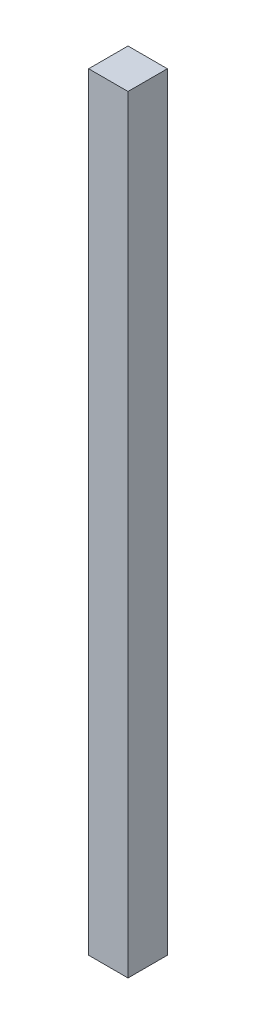
ISO-10303-21;
HEADER;
FILE_DESCRIPTION(('STEP AP214'),'2;1');
FILE_NAME('part.step','',(''),(''),'','','');
FILE_SCHEMA(('AUTOMOTIVE_DESIGN { 1 0 10303 214 1 1 1 1 }'));
ENDSEC;
DATA;
#1=APPLICATION_CONTEXT('core data for automotive mechanical design processes');
#2=APPLICATION_PROTOCOL_DEFINITION('international standard','automotive_design',2000,#1);
#3=PRODUCT_CONTEXT('',#1,'mechanical');
#4=PRODUCT('Part','Part','',(#3));
#5=PRODUCT_RELATED_PRODUCT_CATEGORY('part','',(#4));
#6=PRODUCT_DEFINITION_FORMATION('','',#4);
#7=PRODUCT_DEFINITION_CONTEXT('part definition',#1,'design');
#8=PRODUCT_DEFINITION('design','',#6,#7);
#9=PRODUCT_DEFINITION_SHAPE('','',#8);
#10=(LENGTH_UNIT() NAMED_UNIT(*) SI_UNIT(.MILLI.,.METRE.));
#11=(NAMED_UNIT(*) PLANE_ANGLE_UNIT() SI_UNIT($,.RADIAN.));
#12=(NAMED_UNIT(*) SI_UNIT($,.STERADIAN.) SOLID_ANGLE_UNIT());
#13=UNCERTAINTY_MEASURE_WITH_UNIT(LENGTH_MEASURE(1.E-05),#10,'distance_accuracy_value','');
#14=(GEOMETRIC_REPRESENTATION_CONTEXT(3) GLOBAL_UNCERTAINTY_ASSIGNED_CONTEXT((#13)) GLOBAL_UNIT_ASSIGNED_CONTEXT((#10,
#11,#12)) REPRESENTATION_CONTEXT('',''));
#15=CARTESIAN_POINT('',(0.,0.,0.));
#16=DIRECTION('',(0.,0.,1.));
#17=DIRECTION('',(1.,0.,0.));
#18=AXIS2_PLACEMENT_3D('',#15,#16,#17);
#19=CARTESIAN_POINT('',(1.5875,-30.96006,3.175));
#20=DIRECTION('',(-1.,0.,0.));
#21=DIRECTION('',(0.,0.,1.));
#22=AXIS2_PLACEMENT_3D('',#19,#20,#21);
#23=PLANE('',#22);
#24=DIRECTION('',(0.,1.,0.));
#25=VECTOR('',#24,1.);
#26=CARTESIAN_POINT('',(1.5875,-30.96006,0.));
#27=LINE('',#26,#25);
#28=CARTESIAN_POINT('',(1.5875,-30.96006,0.));
#29=VERTEX_POINT('',#28);
#30=CARTESIAN_POINT('',(1.5875,30.96006,0.));
#31=VERTEX_POINT('',#30);
#32=EDGE_CURVE('E112',#29,#31,#27,.T.);
#33=ORIENTED_EDGE('',*,*,#32,.T.);
#34=DIRECTION('',(0.,0.,-1.));
#35=VECTOR('',#34,1.);
#36=CARTESIAN_POINT('',(1.5875,30.96006,3.175));
#37=LINE('',#36,#35);
#38=CARTESIAN_POINT('',(1.5875,30.96006,3.175));
#39=VERTEX_POINT('',#38);
#40=EDGE_CURVE('E11',#39,#31,#37,.T.);
#41=ORIENTED_EDGE('',*,*,#40,.F.);
#42=DIRECTION('',(0.,1.,0.));
#43=VECTOR('',#42,1.);
#44=CARTESIAN_POINT('',(1.5875,-30.96006,3.175));
#45=LINE('',#44,#43);
#46=CARTESIAN_POINT('',(1.5875,-30.96006,3.175));
#47=VERTEX_POINT('',#46);
#48=EDGE_CURVE('E96',#47,#39,#45,.T.);
#49=ORIENTED_EDGE('',*,*,#48,.F.);
#50=DIRECTION('',(0.,0.,-1.));
#51=VECTOR('',#50,1.);
#52=CARTESIAN_POINT('',(1.5875,-30.96006,3.175));
#53=LINE('',#52,#51);
#54=EDGE_CURVE('E108',#47,#29,#53,.T.);
#55=ORIENTED_EDGE('',*,*,#54,.T.);
#56=EDGE_LOOP('',(#33,#41,#49,#55));
#57=FACE_BOUND('',#56,.T.);
#58=ADVANCED_FACE('F44',(#57),#23,.F.);
#59=CARTESIAN_POINT('',(-1.5875,30.96006,3.175));
#60=DIRECTION('',(0.,-1.,0.));
#61=DIRECTION('',(0.,0.,-1.));
#62=AXIS2_PLACEMENT_3D('',#59,#60,#61);
#63=PLANE('',#62);
#64=DIRECTION('',(-1.,0.,0.));
#65=VECTOR('',#64,1.);
#66=CARTESIAN_POINT('',(-1.5875,30.96006,0.));
#67=LINE('',#66,#65);
#68=CARTESIAN_POINT('',(-1.5875,30.96006,0.));
#69=VERTEX_POINT('',#68);
#70=EDGE_CURVE('E101',#31,#69,#67,.T.);
#71=ORIENTED_EDGE('',*,*,#70,.T.);
#72=DIRECTION('',(0.,0.,-1.));
#73=VECTOR('',#72,1.);
#74=CARTESIAN_POINT('',(-1.5875,30.96006,3.175));
#75=LINE('',#74,#73);
#76=CARTESIAN_POINT('',(-1.5875,30.96006,3.175));
#77=VERTEX_POINT('',#76);
#78=EDGE_CURVE('E53',#77,#69,#75,.T.);
#79=ORIENTED_EDGE('',*,*,#78,.F.);
#80=DIRECTION('',(-1.,0.,0.));
#81=VECTOR('',#80,1.);
#82=CARTESIAN_POINT('',(-1.5875,30.96006,3.175));
#83=LINE('',#82,#81);
#84=EDGE_CURVE('E91',#39,#77,#83,.T.);
#85=ORIENTED_EDGE('',*,*,#84,.F.);
#86=ORIENTED_EDGE('',*,*,#40,.T.);
#87=EDGE_LOOP('',(#71,#79,#85,#86));
#88=FACE_BOUND('',#87,.T.);
#89=ADVANCED_FACE('F100',(#88),#63,.F.);
#90=CARTESIAN_POINT('',(-1.5875,-30.96006,3.175));
#91=DIRECTION('',(1.,0.,0.));
#92=DIRECTION('',(0.,0.,-1.));
#93=AXIS2_PLACEMENT_3D('',#90,#91,#92);
#94=PLANE('',#93);
#95=DIRECTION('',(0.,-1.,0.));
#96=VECTOR('',#95,1.);
#97=CARTESIAN_POINT('',(-1.5875,-30.96006,0.));
#98=LINE('',#97,#96);
#99=CARTESIAN_POINT('',(-1.5875,-30.96006,0.));
#100=VERTEX_POINT('',#99);
#101=EDGE_CURVE('E78',#69,#100,#98,.T.);
#102=ORIENTED_EDGE('',*,*,#101,.T.);
#103=DIRECTION('',(0.,0.,-1.));
#104=VECTOR('',#103,1.);
#105=CARTESIAN_POINT('',(-1.5875,-30.96006,3.175));
#106=LINE('',#105,#104);
#107=CARTESIAN_POINT('',(-1.5875,-30.96006,3.175));
#108=VERTEX_POINT('',#107);
#109=EDGE_CURVE('E103',#108,#100,#106,.T.);
#110=ORIENTED_EDGE('',*,*,#109,.F.);
#111=DIRECTION('',(0.,-1.,0.));
#112=VECTOR('',#111,1.);
#113=CARTESIAN_POINT('',(-1.5875,-30.96006,3.175));
#114=LINE('',#113,#112);
#115=EDGE_CURVE('E94',#77,#108,#114,.T.);
#116=ORIENTED_EDGE('',*,*,#115,.F.);
#117=ORIENTED_EDGE('',*,*,#78,.T.);
#118=EDGE_LOOP('',(#102,#110,#116,#117));
#119=FACE_BOUND('',#118,.T.);
#120=ADVANCED_FACE('F104',(#119),#94,.F.);
#121=CARTESIAN_POINT('',(-1.5875,-30.96006,3.175));
#122=DIRECTION('',(0.,1.,0.));
#123=DIRECTION('',(0.,0.,1.));
#124=AXIS2_PLACEMENT_3D('',#121,#122,#123);
#125=PLANE('',#124);
#126=DIRECTION('',(1.,0.,0.));
#127=VECTOR('',#126,1.);
#128=CARTESIAN_POINT('',(-1.5875,-30.96006,0.));
#129=LINE('',#128,#127);
#130=EDGE_CURVE('E84',#100,#29,#129,.T.);
#131=ORIENTED_EDGE('',*,*,#130,.T.);
#132=ORIENTED_EDGE('',*,*,#54,.F.);
#133=DIRECTION('',(1.,0.,0.));
#134=VECTOR('',#133,1.);
#135=CARTESIAN_POINT('',(-1.5875,-30.96006,3.175));
#136=LINE('',#135,#134);
#137=EDGE_CURVE('E61',#108,#47,#136,.T.);
#138=ORIENTED_EDGE('',*,*,#137,.F.);
#139=ORIENTED_EDGE('',*,*,#109,.T.);
#140=EDGE_LOOP('',(#131,#132,#138,#139));
#141=FACE_BOUND('',#140,.T.);
#142=ADVANCED_FACE('F125',(#141),#125,.F.);
#143=CARTESIAN_POINT('',(0.,0.,3.175));
#144=DIRECTION('',(0.,0.,-1.));
#145=DIRECTION('',(-1.,0.,0.));
#146=AXIS2_PLACEMENT_3D('',#143,#144,#145);
#147=PLANE('',#146);
#148=ORIENTED_EDGE('',*,*,#48,.T.);
#149=ORIENTED_EDGE('',*,*,#84,.T.);
#150=ORIENTED_EDGE('',*,*,#115,.T.);
#151=ORIENTED_EDGE('',*,*,#137,.T.);
#152=EDGE_LOOP('',(#148,#149,#150,#151));
#153=FACE_BOUND('',#152,.T.);
#154=ADVANCED_FACE('F92',(#153),#147,.F.);
#155=CARTESIAN_POINT('',(0.,0.,0.));
#156=DIRECTION('',(0.,0.,-1.));
#157=DIRECTION('',(-1.,0.,0.));
#158=AXIS2_PLACEMENT_3D('',#155,#156,#157);
#159=PLANE('',#158);
#160=ORIENTED_EDGE('',*,*,#32,.F.);
#161=ORIENTED_EDGE('',*,*,#130,.F.);
#162=ORIENTED_EDGE('',*,*,#101,.F.);
#163=ORIENTED_EDGE('',*,*,#70,.F.);
#164=EDGE_LOOP('',(#160,#161,#162,#163));
#165=FACE_BOUND('',#164,.T.);
#166=ADVANCED_FACE('F128',(#165),#159,.T.);
#167=CLOSED_SHELL('',(#58,#89,#120,#142,#154,#166));
#168=MANIFOLD_SOLID_BREP('B2',#167);
#169=ADVANCED_BREP_SHAPE_REPRESENTATION('',(#18,#168),#14);
#170=SHAPE_DEFINITION_REPRESENTATION(#9,#169);
ENDSEC;
END-ISO-10303-21;
